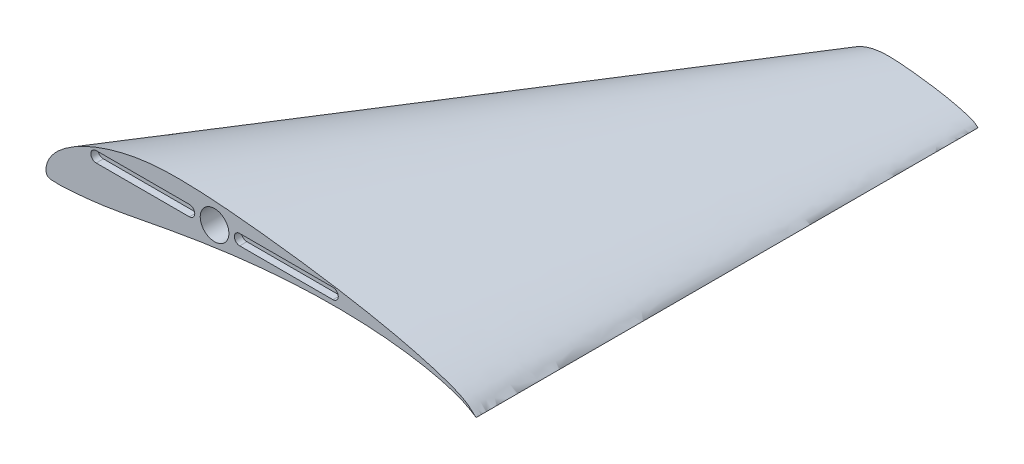
ISO-10303-21;
HEADER;
FILE_DESCRIPTION(('STEP AP214'),'2;1');
FILE_NAME('part.step','',(''),(''),'','','');
FILE_SCHEMA(('AUTOMOTIVE_DESIGN { 1 0 10303 214 1 1 1 1 }'));
ENDSEC;
DATA;
#1=APPLICATION_CONTEXT('core data for automotive mechanical design processes');
#2=APPLICATION_PROTOCOL_DEFINITION('international standard','automotive_design',2000,#1);
#3=PRODUCT_CONTEXT('',#1,'mechanical');
#4=PRODUCT('Part','Part','',(#3));
#5=PRODUCT_RELATED_PRODUCT_CATEGORY('part','',(#4));
#6=PRODUCT_DEFINITION_FORMATION('','',#4);
#7=PRODUCT_DEFINITION_CONTEXT('part definition',#1,'design');
#8=PRODUCT_DEFINITION('design','',#6,#7);
#9=PRODUCT_DEFINITION_SHAPE('','',#8);
#10=(LENGTH_UNIT() NAMED_UNIT(*) SI_UNIT(.MILLI.,.METRE.));
#11=(NAMED_UNIT(*) PLANE_ANGLE_UNIT() SI_UNIT($,.RADIAN.));
#12=(NAMED_UNIT(*) SI_UNIT($,.STERADIAN.) SOLID_ANGLE_UNIT());
#13=UNCERTAINTY_MEASURE_WITH_UNIT(LENGTH_MEASURE(1.E-05),#10,'distance_accuracy_value','');
#14=(GEOMETRIC_REPRESENTATION_CONTEXT(3) GLOBAL_UNCERTAINTY_ASSIGNED_CONTEXT((#13)) GLOBAL_UNIT_ASSIGNED_CONTEXT((#10,
#11,#12)) REPRESENTATION_CONTEXT('',''));
#15=CARTESIAN_POINT('',(0.,0.,0.));
#16=DIRECTION('',(0.,0.,1.));
#17=DIRECTION('',(1.,0.,0.));
#18=AXIS2_PLACEMENT_3D('',#15,#16,#17);
#19=CARTESIAN_POINT('',(0.358648893938825,1.31203835702179,0.));
#20=DIRECTION('',(0.,0.,1.));
#21=DIRECTION('',(-1.,0.,0.));
#22=AXIS2_PLACEMENT_3D('',#19,#20,#21);
#23=PLANE('',#22);
#24=CARTESIAN_POINT('',(40.02,5.,0.));
#25=DIRECTION('',(0.,0.,-1.));
#26=DIRECTION('',(-1.,0.,0.));
#27=AXIS2_PLACEMENT_3D('',#24,#25,#26);
#28=CIRCLE('',#27,0.750000000000008);
#29=CARTESIAN_POINT('',(40.02,5.75000000000001,0.));
#30=VERTEX_POINT('',#29);
#31=CARTESIAN_POINT('',(40.02,4.24999999999999,0.));
#32=VERTEX_POINT('',#31);
#33=EDGE_CURVE('E145',#30,#32,#28,.T.);
#34=ORIENTED_EDGE('',*,*,#33,.T.);
#35=DIRECTION('',(-1.,0.,0.));
#36=VECTOR('',#35,1.);
#37=CARTESIAN_POINT('',(40.02,4.24999999999999,0.));
#38=LINE('',#37,#36);
#39=CARTESIAN_POINT('',(27.02,4.25,0.));
#40=VERTEX_POINT('',#39);
#41=EDGE_CURVE('E163',#32,#40,#38,.T.);
#42=ORIENTED_EDGE('',*,*,#41,.T.);
#43=CARTESIAN_POINT('',(27.02,5.,0.));
#44=DIRECTION('',(0.,0.,-1.));
#45=DIRECTION('',(-1.,0.,0.));
#46=AXIS2_PLACEMENT_3D('',#43,#44,#45);
#47=CIRCLE('',#46,0.749999999999999);
#48=CARTESIAN_POINT('',(27.02,5.75,0.));
#49=VERTEX_POINT('',#48);
#50=EDGE_CURVE('E166',#40,#49,#47,.T.);
#51=ORIENTED_EDGE('',*,*,#50,.T.);
#52=DIRECTION('',(-1.,0.,0.));
#53=VECTOR('',#52,1.);
#54=CARTESIAN_POINT('',(40.02,5.75000000000001,0.));
#55=LINE('',#54,#53);
#56=EDGE_CURVE('E154',#30,#49,#55,.T.);
#57=ORIENTED_EDGE('',*,*,#56,.F.);
#58=EDGE_LOOP('',(#34,#42,#51,#57));
#59=FACE_BOUND('',#58,.T.);
#60=CARTESIAN_POINT('',(23.51,5.,0.));
#61=DIRECTION('',(0.,0.,-1.));
#62=DIRECTION('',(-1.,0.,0.));
#63=AXIS2_PLACEMENT_3D('',#60,#61,#62);
#64=CIRCLE('',#63,2.);
#65=CARTESIAN_POINT('',(21.51,5.,0.));
#66=VERTEX_POINT('',#65);
#67=EDGE_CURVE('E173',#66,#66,#64,.T.);
#68=ORIENTED_EDGE('',*,*,#67,.T.);
#69=EDGE_LOOP('',(#68));
#70=FACE_BOUND('',#69,.T.);
#71=CARTESIAN_POINT('',(60.,0.,0.));
#72=CARTESIAN_POINT('',(60.0003591967076,0.00152743166866113,0.));
#73=CARTESIAN_POINT('',(59.8031171503171,0.148486190866981,0.));
#74=CARTESIAN_POINT('',(59.6363051275394,0.312157693204799,0.));
#75=CARTESIAN_POINT('',(59.265915035483,0.654017791026096,0.));
#76=CARTESIAN_POINT('',(58.828941407944,1.01769187040323,0.));
#77=CARTESIAN_POINT('',(58.2311986071286,1.38431433802317,0.));
#78=CARTESIAN_POINT('',(57.4879028587413,1.73962008144949,0.));
#79=CARTESIAN_POINT('',(56.5905605509476,2.11038996867272,0.));
#80=CARTESIAN_POINT('',(55.5405906841004,2.49165505155028,0.));
#81=CARTESIAN_POINT('',(54.3426606505066,2.87984653664435,0.));
#82=CARTESIAN_POINT('',(53.0044503542957,3.27530791932623,0.));
#83=CARTESIAN_POINT('',(51.5282398733248,3.65993308110928,0.));
#84=CARTESIAN_POINT('',(49.9318628263046,4.06561454332629,0.));
#85=CARTESIAN_POINT('',(48.2145350695117,4.45252726033602,0.));
#86=CARTESIAN_POINT('',(46.3922162813386,4.8372114388325,0.));
#87=CARTESIAN_POINT('',(44.4741846373565,5.21215240354569,0.));
#88=CARTESIAN_POINT('',(42.4720640696188,5.57436949248205,0.));
#89=CARTESIAN_POINT('',(40.3983436281798,5.92287598001367,0.));
#90=CARTESIAN_POINT('',(38.2650079778576,6.25331693697473,0.));
#91=CARTESIAN_POINT('',(36.0858440170008,6.56630027476171,0.));
#92=CARTESIAN_POINT('',(33.8748202071201,6.85935611065016,0.));
#93=CARTESIAN_POINT('',(31.6479502828675,7.13154383170439,0.));
#94=CARTESIAN_POINT('',(29.4230365764783,7.38479145195094,0.));
#95=CARTESIAN_POINT('',(27.2184980068069,7.61270867154978,0.));
#96=CARTESIAN_POINT('',(25.052294626095,7.81102981614016,0.));
#97=CARTESIAN_POINT('',(22.9396617347882,7.96859227406435,0.));
#98=CARTESIAN_POINT('',(20.8926674686435,8.07697502334032,0.));
#99=CARTESIAN_POINT('',(18.9226999256131,8.12377974427893,0.));
#100=CARTESIAN_POINT('',(17.0398509693804,8.11879768752978,0.));
#101=CARTESIAN_POINT('',(15.2476328415943,8.02660789751006,0.));
#102=CARTESIAN_POINT('',(13.5453512859509,7.839789441016,0.));
#103=CARTESIAN_POINT('',(11.926076695069,7.57562537309296,0.));
#104=CARTESIAN_POINT('',(10.3894182556015,7.23340315512576,0.));
#105=CARTESIAN_POINT('',(8.93695465998708,6.83209986705336,0.));
#106=CARTESIAN_POINT('',(7.57483146116029,6.37882320453374,0.));
#107=CARTESIAN_POINT('',(6.30884164347269,5.88417305863267,0.));
#108=CARTESIAN_POINT('',(5.14685221592727,5.35079958311253,0.));
#109=CARTESIAN_POINT('',(4.09258962341009,4.78953179393415,0.));
#110=CARTESIAN_POINT('',(3.15178940082182,4.20675239007223,0.));
#111=CARTESIAN_POINT('',(2.33035140361199,3.61035853790743,0.));
#112=CARTESIAN_POINT('',(1.62861455630535,3.01299152689761,0.));
#113=CARTESIAN_POINT('',(1.05675527613261,2.40813064719845,0.));
#114=CARTESIAN_POINT('',(0.617494407148315,1.80101400701995,0.));
#115=CARTESIAN_POINT('',(0.2930234664486,1.21037036917539,0.));
#116=CARTESIAN_POINT('',(0.0850719316488285,0.649582218808172,0.));
#117=CARTESIAN_POINT('',(-0.0140169847637187,0.131974925650224,0.));
#118=CARTESIAN_POINT('',(0.0051098577528765,-0.305798157678561,0.));
#119=CARTESIAN_POINT('',(0.117816244960925,-0.707306615975616,0.));
#120=CARTESIAN_POINT('',(0.536763933386814,-0.90661835605631,0.));
#121=CARTESIAN_POINT('',(1.10004460153965,-0.934581165480218,0.));
#122=CARTESIAN_POINT('',(1.8706104555078,-0.961682830343907,0.));
#123=CARTESIAN_POINT('',(2.8396514000118,-0.919895750020732,0.));
#124=CARTESIAN_POINT('',(3.99621535818404,-0.843103830870702,0.));
#125=CARTESIAN_POINT('',(5.3274309804443,-0.720099828376295,0.));
#126=CARTESIAN_POINT('',(6.81967624191513,-0.553670124333049,0.));
#127=CARTESIAN_POINT('',(8.46567456259763,-0.340243437522128,0.));
#128=CARTESIAN_POINT('',(10.2646215673956,-0.0419478858174395,0.));
#129=CARTESIAN_POINT('',(12.2252761749415,0.332109900745339,0.));
#130=CARTESIAN_POINT('',(14.3574403385057,0.739204137605637,0.));
#131=CARTESIAN_POINT('',(16.650692213626,1.16903728804964,0.));
#132=CARTESIAN_POINT('',(19.0906277666481,1.60376835003282,0.));
#133=CARTESIAN_POINT('',(21.6593280235428,2.02708237663987,0.));
#134=CARTESIAN_POINT('',(24.3368648292331,2.42484380478589,0.));
#135=CARTESIAN_POINT('',(27.1001632949703,2.78246131453942,0.));
#136=CARTESIAN_POINT('',(29.9243738514525,3.08952194695553,0.));
#137=CARTESIAN_POINT('',(32.7828181702501,3.33224073356768,0.));
#138=CARTESIAN_POINT('',(35.6468110581785,3.5042984247576,0.));
#139=CARTESIAN_POINT('',(38.4864311413307,3.59888806789702,0.));
#140=CARTESIAN_POINT('',(41.270873524825,3.61083541756505,0.));
#141=CARTESIAN_POINT('',(43.9690733929395,3.53932870712883,0.));
#142=CARTESIAN_POINT('',(46.5501347587453,3.38604192261378,0.));
#143=CARTESIAN_POINT('',(48.9830207247781,3.15295287632235,0.));
#144=CARTESIAN_POINT('',(51.2387663269364,2.84900866508274,0.));
#145=CARTESIAN_POINT('',(53.2880024798237,2.48302860424677,0.));
#146=CARTESIAN_POINT('',(55.1067027969541,2.06726981959666,0.));
#147=CARTESIAN_POINT('',(56.6613494668884,1.62238939798338,0.));
#148=CARTESIAN_POINT('',(57.9336674364374,1.14757460538814,0.));
#149=CARTESIAN_POINT('',(58.8414335563824,0.71305828177372,0.));
#150=CARTESIAN_POINT('',(59.510705283188,0.311289893981384,0.));
#151=CARTESIAN_POINT('',(59.7678107009083,0.155812155482037,0.));
#152=CARTESIAN_POINT('',(59.9996335008558,-0.00155848421639207,0.));
#153=CARTESIAN_POINT('',(60.,0.,0.));
#154=B_SPLINE_CURVE_WITH_KNOTS('',3,(#71,#72,#73,#74,#75,#76,#77,#78,#79,#80,#81,#82,#83,#84,
#85,#86,#87,#88,#89,#90,#91,#92,#93,#94,#95,#96,#97,#98,#99,#100,#101,#102,#103,#104,#105,#106,
#107,#108,#109,#110,#111,#112,#113,#114,#115,#116,#117,#118,#119,#120,#121,#122,#123,#124,#125,
#126,#127,#128,#129,#130,#131,#132,#133,#134,#135,#136,#137,#138,#139,#140,#141,#142,#143,#144,
#145,#146,#147,#148,#149,#150,#151,#152,#153),.UNSPECIFIED.,.T.,.F.,(4,1,1,1,1,1,1,1,1,1,1,1,1,
1,1,1,1,1,1,1,1,1,1,1,1,1,1,1,1,1,1,1,1,1,1,1,1,1,1,1,1,1,1,1,1,1,1,1,1,1,1,1,1,1,1,1,1,1,1,1,1,
1,1,1,1,1,1,1,1,1,1,1,1,1,1,1,1,1,1,1,4),(0.,0.000979678264274593,0.00364886480154598,
0.0074835039211375,0.0120952859160778,0.0175256034270145,0.0240517973546713,0.0317830734940624,
0.0406778574448995,0.0507103373936484,0.0618332736939838,0.0739782064365048,0.0871175142640213,
0.101144399967861,0.115989999025582,0.131569794799979,0.147787764168625,0.164550313847436,
0.18175730453571,0.199311377000208,0.217094506604148,0.234989676272761,0.252856343827104,
0.270540067198934,0.287886265256047,0.304772935778624,0.321100929178702,0.336805584475211,
0.351799564707225,0.36603060578736,0.379615227120614,0.392652524490402,0.405169929353884,
0.417171498359163,0.428603104471847,0.439418554475609,0.449596188777818,0.459101688677971,
0.467907493465564,0.475987922499971,0.48330859579372,0.48987413960304,0.495802885785267,
0.501149051620522,0.505902716612247,0.510046414883828,0.513578959578029,0.51644657759361,
0.519349705653263,0.52382301147072,0.529973454728372,0.537715320706753,0.54696751748529,
0.557637047524215,0.569620170444662,0.582803823079722,0.597246670080713,0.613134757411944,
0.630443333580543,0.649055870293966,0.668822017748496,0.68959473994942,0.711189442398585,
0.733426496549274,0.756093941450603,0.778988394156727,0.80188953968707,0.824566471200233,
0.846792174293647,0.868338195473131,0.888978082822463,0.908491945289234,0.926658714643544,
0.943286152105764,0.958169180164938,0.971135800800317,0.981955610055375,0.990251783989627,
0.995852562256305,0.999000404965184,1.),.UNSPECIFIED.);
#155=CARTESIAN_POINT('',(60.,0.,0.));
#156=VERTEX_POINT('',#155);
#157=EDGE_CURVE('E12',#156,#156,#154,.T.);
#158=ORIENTED_EDGE('',*,*,#157,.T.);
#159=EDGE_LOOP('',(#158));
#160=FACE_BOUND('',#159,.T.);
#161=DIRECTION('',(1.,0.,0.));
#162=VECTOR('',#161,1.);
#163=CARTESIAN_POINT('',(7.,5.75000000000001,0.));
#164=LINE('',#163,#162);
#165=CARTESIAN_POINT('',(7.,5.75000000000001,0.));
#166=VERTEX_POINT('',#165);
#167=CARTESIAN_POINT('',(20.,5.75,0.));
#168=VERTEX_POINT('',#167);
#169=EDGE_CURVE('E120',#166,#168,#164,.T.);
#170=ORIENTED_EDGE('',*,*,#169,.T.);
#171=CARTESIAN_POINT('',(20.,5.,0.));
#172=DIRECTION('',(0.,0.,1.));
#173=DIRECTION('',(1.,0.,0.));
#174=AXIS2_PLACEMENT_3D('',#171,#172,#173);
#175=CIRCLE('',#174,0.749999999999999);
#176=CARTESIAN_POINT('',(20.,4.25,0.));
#177=VERTEX_POINT('',#176);
#178=EDGE_CURVE('E127',#177,#168,#175,.T.);
#179=ORIENTED_EDGE('',*,*,#178,.F.);
#180=DIRECTION('',(1.,0.,0.));
#181=VECTOR('',#180,1.);
#182=CARTESIAN_POINT('',(7.,4.24999999999999,0.));
#183=LINE('',#182,#181);
#184=CARTESIAN_POINT('',(7.,4.24999999999999,0.));
#185=VERTEX_POINT('',#184);
#186=EDGE_CURVE('E133',#185,#177,#183,.T.);
#187=ORIENTED_EDGE('',*,*,#186,.F.);
#188=CARTESIAN_POINT('',(7.,5.,0.));
#189=DIRECTION('',(0.,0.,1.));
#190=DIRECTION('',(1.,0.,0.));
#191=AXIS2_PLACEMENT_3D('',#188,#189,#190);
#192=CIRCLE('',#191,0.750000000000008);
#193=EDGE_CURVE('E135',#166,#185,#192,.T.);
#194=ORIENTED_EDGE('',*,*,#193,.F.);
#195=EDGE_LOOP('',(#170,#179,#187,#194));
#196=FACE_BOUND('',#195,.T.);
#197=ADVANCED_FACE('F44',(#59,#70,#160,#196),#23,.T.);
#198=CARTESIAN_POINT('',(42.1075946681816,0.393611507106538,-70.));
#199=DIRECTION('',(0.,0.,1.));
#200=DIRECTION('',(-1.,0.,0.));
#201=AXIS2_PLACEMENT_3D('',#198,#199,#200);
#202=PLANE('',#201);
#203=CARTESIAN_POINT('',(60.,0.,-70.));
#204=CARTESIAN_POINT('',(60.0001077590123,0.00045822950059834,-70.));
#205=CARTESIAN_POINT('',(59.9409351450951,0.0445458572600942,-70.));
#206=CARTESIAN_POINT('',(59.8908915382618,0.0936473079614398,-70.));
#207=CARTESIAN_POINT('',(59.7797745106449,0.196205337307829,-70.));
#208=CARTESIAN_POINT('',(59.6486824223832,0.305307561120969,-70.));
#209=CARTESIAN_POINT('',(59.4693595821386,0.415294301406952,-70.));
#210=CARTESIAN_POINT('',(59.2463708576224,0.521886024434847,-70.));
#211=CARTESIAN_POINT('',(58.9771681652843,0.633116990601815,-70.));
#212=CARTESIAN_POINT('',(58.6621772052301,0.747496515465083,-70.));
#213=CARTESIAN_POINT('',(58.302798195152,0.863953960993304,-70.));
#214=CARTESIAN_POINT('',(57.9013351062887,0.982592375797868,-70.));
#215=CARTESIAN_POINT('',(57.4584719619975,1.09797992433278,-70.));
#216=CARTESIAN_POINT('',(56.9795588478914,1.21968436299789,-70.));
#217=CARTESIAN_POINT('',(56.4643605208535,1.33575817810081,-70.));
#218=CARTESIAN_POINT('',(55.9176648844016,1.45116343164975,-70.));
#219=CARTESIAN_POINT('',(55.3422553912069,1.56364572106371,-70.));
#220=CARTESIAN_POINT('',(54.7416192208856,1.67231084774462,-70.));
#221=CARTESIAN_POINT('',(54.119503088454,1.7768627940041,-70.));
#222=CARTESIAN_POINT('',(53.4795023933573,1.87599508109242,-70.));
#223=CARTESIAN_POINT('',(52.8257532051002,1.96989008242851,-70.));
#224=CARTESIAN_POINT('',(52.162446062136,2.05780683319505,-70.));
#225=CARTESIAN_POINT('',(51.4943850848603,2.13946314951132,-70.));
#226=CARTESIAN_POINT('',(50.8269109729435,2.21543743558528,-70.));
#227=CARTESIAN_POINT('',(50.1655494020421,2.28381260146493,-70.));
#228=CARTESIAN_POINT('',(49.5156883878285,2.34330894484205,-70.));
#229=CARTESIAN_POINT('',(48.8818985204364,2.39057768221931,-70.));
#230=CARTESIAN_POINT('',(48.2678002405931,2.42309250700209,-70.));
#231=CARTESIAN_POINT('',(47.6768099776839,2.43713392328368,-70.));
#232=CARTESIAN_POINT('',(47.1119552908141,2.43563930625894,-70.));
#233=CARTESIAN_POINT('',(46.5742898524783,2.40798236925302,-70.));
#234=CARTESIAN_POINT('',(46.0636053857853,2.3519368323048,-70.));
#235=CARTESIAN_POINT('',(45.5778230085207,2.27268761192789,-70.));
#236=CARTESIAN_POINT('',(45.1168254766805,2.17002094653773,-70.));
#237=CARTESIAN_POINT('',(44.6810863979961,2.04962996011601,-70.));
#238=CARTESIAN_POINT('',(44.2724494383481,1.91364696136012,-70.));
#239=CARTESIAN_POINT('',(43.8926524930418,1.7652519175898,-70.));
#240=CARTESIAN_POINT('',(43.5440556647782,1.60523987493376,-70.));
#241=CARTESIAN_POINT('',(43.227776887023,1.43685953818025,-70.));
#242=CARTESIAN_POINT('',(42.9455368202465,1.26202571702167,-70.));
#243=CARTESIAN_POINT('',(42.6991054210836,1.08310756137223,-70.));
#244=CARTESIAN_POINT('',(42.4885843668916,0.903897458069282,-70.));
#245=CARTESIAN_POINT('',(42.3170265828398,0.722439194159534,-70.));
#246=CARTESIAN_POINT('',(42.1852483221445,0.540304202105985,-70.));
#247=CARTESIAN_POINT('',(42.0879070399346,0.363111110752618,-70.));
#248=CARTESIAN_POINT('',(42.0255215794946,0.194874665642452,-70.));
#249=CARTESIAN_POINT('',(41.9957949045709,0.0395924776950672,-70.));
#250=CARTESIAN_POINT('',(42.0015329573259,-0.0917394473035684,-70.));
#251=CARTESIAN_POINT('',(42.0353448734883,-0.212191984792685,-70.));
#252=CARTESIAN_POINT('',(42.161029180016,-0.271985506816893,-70.));
#253=CARTESIAN_POINT('',(42.3300133804619,-0.280374349644065,-70.));
#254=CARTESIAN_POINT('',(42.5611831366523,-0.288504849103172,-70.));
#255=CARTESIAN_POINT('',(42.8518954200035,-0.27596872500622,-70.));
#256=CARTESIAN_POINT('',(43.1988646074552,-0.252931149261211,-70.));
#257=CARTESIAN_POINT('',(43.5982292941333,-0.216029948512889,-70.));
#258=CARTESIAN_POINT('',(44.0459028725745,-0.166101037299915,-70.));
#259=CARTESIAN_POINT('',(44.5397023687793,-0.102073031256638,-70.));
#260=CARTESIAN_POINT('',(45.0793864702187,-0.0125843657452318,-70.));
#261=CARTESIAN_POINT('',(45.6675828524825,0.0996329702236017,-70.));
#262=CARTESIAN_POINT('',(46.3072321015517,0.221761241281691,-70.));
#263=CARTESIAN_POINT('',(46.9952076640878,0.350711186414893,-70.));
#264=CARTESIAN_POINT('',(47.7271883299944,0.481130505009847,-70.));
#265=CARTESIAN_POINT('',(48.4977984070628,0.608124712991961,-70.));
#266=CARTESIAN_POINT('',(49.3010594487699,0.727453141435768,-70.));
#267=CARTESIAN_POINT('',(50.1300489884911,0.834738394361826,-70.));
#268=CARTESIAN_POINT('',(50.9773121554357,0.926856584086659,-70.));
#269=CARTESIAN_POINT('',(51.834845451075,0.999672220070305,-70.));
#270=CARTESIAN_POINT('',(52.6940433174535,1.05128952742728,-70.));
#271=CARTESIAN_POINT('',(53.5459293423992,1.07966642036911,-70.));
#272=CARTESIAN_POINT('',(54.3812620574475,1.08325062526952,-70.));
#273=CARTESIAN_POINT('',(55.1907220178818,1.06179861213865,-70.));
#274=CARTESIAN_POINT('',(55.9650404276236,1.01581257678414,-70.));
#275=CARTESIAN_POINT('',(56.6949062174334,0.945885862896706,-70.));
#276=CARTESIAN_POINT('',(57.3716298980809,0.854702599524822,-70.));
#277=CARTESIAN_POINT('',(57.9864007439471,0.744908581274031,-70.));
#278=CARTESIAN_POINT('',(58.5320108390862,0.620180945878999,-70.));
#279=CARTESIAN_POINT('',(58.9984048400665,0.486716819395014,-70.));
#280=CARTESIAN_POINT('',(59.3801002309312,0.344272381616441,-70.));
#281=CARTESIAN_POINT('',(59.6524300669147,0.213917484532116,-70.));
#282=CARTESIAN_POINT('',(59.8532115849564,0.0933869681944152,-70.));
#283=CARTESIAN_POINT('',(59.9303432102725,0.0467436466446112,-70.));
#284=CARTESIAN_POINT('',(59.9998900502568,-0.000467545264917618,-70.));
#285=CARTESIAN_POINT('',(60.,0.,-70.));
#286=B_SPLINE_CURVE_WITH_KNOTS('',3,(#203,#204,#205,#206,#207,#208,#209,#210,#211,#212,#213,
#214,#215,#216,#217,#218,#219,#220,#221,#222,#223,#224,#225,#226,#227,#228,#229,#230,#231,#232,
#233,#234,#235,#236,#237,#238,#239,#240,#241,#242,#243,#244,#245,#246,#247,#248,#249,#250,#251,
#252,#253,#254,#255,#256,#257,#258,#259,#260,#261,#262,#263,#264,#265,#266,#267,#268,#269,#270,
#271,#272,#273,#274,#275,#276,#277,#278,#279,#280,#281,#282,#283,#284,#285),.UNSPECIFIED.,.T.,
.F.,(4,1,1,1,1,1,1,1,1,1,1,1,1,1,1,1,1,1,1,1,1,1,1,1,1,1,1,1,1,1,1,1,1,1,1,1,1,1,1,1,1,1,1,1,1,
1,1,1,1,1,1,1,1,1,1,1,1,1,1,1,1,1,1,1,1,1,1,1,1,1,1,1,1,1,1,1,1,1,1,1,4),(0.,
0.000979678264274593,0.00364886480154598,0.0074835039211375,0.0120952859160778,
0.0175256034270145,0.0240517973546713,0.0317830734940624,0.0406778574448995,0.0507103373936484,
0.0618332736939838,0.0739782064365048,0.0871175142640213,0.101144399967861,0.115989999025582,
0.131569794799979,0.147787764168625,0.164550313847436,0.18175730453571,0.199311377000208,
0.217094506604148,0.234989676272761,0.252856343827104,0.270540067198934,0.287886265256047,
0.304772935778624,0.321100929178702,0.336805584475211,0.351799564707225,0.36603060578736,
0.379615227120614,0.392652524490402,0.405169929353884,0.417171498359163,0.428603104471847,
0.439418554475609,0.449596188777818,0.459101688677971,0.467907493465564,0.475987922499971,
0.48330859579372,0.48987413960304,0.495802885785267,0.501149051620522,0.505902716612247,
0.510046414883828,0.513578959578029,0.51644657759361,0.519349705653263,0.52382301147072,
0.529973454728372,0.537715320706753,0.54696751748529,0.557637047524215,0.569620170444662,
0.582803823079722,0.597246670080713,0.613134757411944,0.630443333580543,0.649055870293966,
0.668822017748496,0.68959473994942,0.711189442398585,0.733426496549274,0.756093941450603,
0.778988394156727,0.80188953968707,0.824566471200233,0.846792174293647,0.868338195473131,
0.888978082822463,0.908491945289234,0.926658714643544,0.943286152105764,0.958169180164938,
0.971135800800317,0.981955610055375,0.990251783989627,0.995852562256305,0.999000404965184,1.),.UNSPECIFIED.);
#287=CARTESIAN_POINT('',(60.,0.,-70.));
#288=VERTEX_POINT('',#287);
#289=EDGE_CURVE('E54',#288,#288,#286,.T.);
#290=ORIENTED_EDGE('',*,*,#289,.F.);
#291=EDGE_LOOP('',(#290));
#292=FACE_BOUND('',#291,.T.);
#293=ADVANCED_FACE('F205',(#292),#202,.F.);
#294=CARTESIAN_POINT('',(60.,0.,-70.));
#295=CARTESIAN_POINT('',(60.,0.,0.));
#296=CARTESIAN_POINT('',(59.9998900502568,-0.000467545264917618,-70.));
#297=CARTESIAN_POINT('',(59.9996335008558,-0.00155848421639207,0.));
#298=CARTESIAN_POINT('',(59.9303432102725,0.0467436466446112,-70.));
#299=CARTESIAN_POINT('',(59.7678107009083,0.155812155482037,0.));
#300=CARTESIAN_POINT('',(59.8532115849564,0.0933869681944152,-70.));
#301=CARTESIAN_POINT('',(59.510705283188,0.311289893981384,0.));
#302=CARTESIAN_POINT('',(59.6524300669147,0.213917484532116,-70.));
#303=CARTESIAN_POINT('',(58.8414335563824,0.71305828177372,0.));
#304=CARTESIAN_POINT('',(59.3801002309312,0.344272381616441,-70.));
#305=CARTESIAN_POINT('',(57.9336674364374,1.14757460538814,0.));
#306=CARTESIAN_POINT('',(58.9984048400665,0.486716819395014,-70.));
#307=CARTESIAN_POINT('',(56.6613494668884,1.62238939798338,0.));
#308=CARTESIAN_POINT('',(58.5320108390862,0.620180945878999,-70.));
#309=CARTESIAN_POINT('',(55.1067027969541,2.06726981959666,0.));
#310=CARTESIAN_POINT('',(57.9864007439471,0.744908581274031,-70.));
#311=CARTESIAN_POINT('',(53.2880024798237,2.48302860424677,0.));
#312=CARTESIAN_POINT('',(57.3716298980809,0.854702599524822,-70.));
#313=CARTESIAN_POINT('',(51.2387663269364,2.84900866508274,0.));
#314=CARTESIAN_POINT('',(56.6949062174334,0.945885862896706,-70.));
#315=CARTESIAN_POINT('',(48.9830207247781,3.15295287632235,0.));
#316=CARTESIAN_POINT('',(55.9650404276236,1.01581257678414,-70.));
#317=CARTESIAN_POINT('',(46.5501347587453,3.38604192261378,0.));
#318=CARTESIAN_POINT('',(55.1907220178818,1.06179861213865,-70.));
#319=CARTESIAN_POINT('',(43.9690733929395,3.53932870712883,0.));
#320=CARTESIAN_POINT('',(54.3812620574475,1.08325062526952,-70.));
#321=CARTESIAN_POINT('',(41.270873524825,3.61083541756505,0.));
#322=CARTESIAN_POINT('',(53.5459293423992,1.07966642036911,-70.));
#323=CARTESIAN_POINT('',(38.4864311413307,3.59888806789702,0.));
#324=CARTESIAN_POINT('',(52.6940433174535,1.05128952742728,-70.));
#325=CARTESIAN_POINT('',(35.6468110581785,3.5042984247576,0.));
#326=CARTESIAN_POINT('',(51.834845451075,0.999672220070305,-70.));
#327=CARTESIAN_POINT('',(32.7828181702501,3.33224073356768,0.));
#328=CARTESIAN_POINT('',(50.9773121554357,0.926856584086659,-70.));
#329=CARTESIAN_POINT('',(29.9243738514525,3.08952194695553,0.));
#330=CARTESIAN_POINT('',(50.1300489884911,0.834738394361826,-70.));
#331=CARTESIAN_POINT('',(27.1001632949703,2.78246131453942,0.));
#332=CARTESIAN_POINT('',(49.3010594487699,0.727453141435768,-70.));
#333=CARTESIAN_POINT('',(24.3368648292331,2.42484380478589,0.));
#334=CARTESIAN_POINT('',(48.4977984070628,0.608124712991961,-70.));
#335=CARTESIAN_POINT('',(21.6593280235428,2.02708237663987,0.));
#336=CARTESIAN_POINT('',(47.7271883299944,0.481130505009847,-70.));
#337=CARTESIAN_POINT('',(19.0906277666481,1.60376835003282,0.));
#338=CARTESIAN_POINT('',(46.9952076640878,0.350711186414893,-70.));
#339=CARTESIAN_POINT('',(16.650692213626,1.16903728804964,0.));
#340=CARTESIAN_POINT('',(46.3072321015517,0.221761241281691,-70.));
#341=CARTESIAN_POINT('',(14.3574403385057,0.739204137605637,0.));
#342=CARTESIAN_POINT('',(45.6675828524825,0.0996329702236017,-70.));
#343=CARTESIAN_POINT('',(12.2252761749415,0.332109900745339,0.));
#344=CARTESIAN_POINT('',(45.0793864702187,-0.0125843657452318,-70.));
#345=CARTESIAN_POINT('',(10.2646215673956,-0.0419478858174395,0.));
#346=CARTESIAN_POINT('',(44.5397023687793,-0.102073031256638,-70.));
#347=CARTESIAN_POINT('',(8.46567456259763,-0.340243437522128,0.));
#348=CARTESIAN_POINT('',(44.0459028725745,-0.166101037299915,-70.));
#349=CARTESIAN_POINT('',(6.81967624191513,-0.553670124333049,0.));
#350=CARTESIAN_POINT('',(43.5982292941333,-0.216029948512889,-70.));
#351=CARTESIAN_POINT('',(5.3274309804443,-0.720099828376295,0.));
#352=CARTESIAN_POINT('',(43.1988646074552,-0.252931149261211,-70.));
#353=CARTESIAN_POINT('',(3.99621535818404,-0.843103830870702,0.));
#354=CARTESIAN_POINT('',(42.8518954200035,-0.27596872500622,-70.));
#355=CARTESIAN_POINT('',(2.8396514000118,-0.919895750020732,0.));
#356=CARTESIAN_POINT('',(42.5611831366523,-0.288504849103172,-70.));
#357=CARTESIAN_POINT('',(1.8706104555078,-0.961682830343907,0.));
#358=CARTESIAN_POINT('',(42.3300133804619,-0.280374349644065,-70.));
#359=CARTESIAN_POINT('',(1.10004460153965,-0.934581165480218,0.));
#360=CARTESIAN_POINT('',(42.161029180016,-0.271985506816893,-70.));
#361=CARTESIAN_POINT('',(0.536763933386814,-0.90661835605631,0.));
#362=CARTESIAN_POINT('',(42.0353448734883,-0.212191984792685,-70.));
#363=CARTESIAN_POINT('',(0.117816244960925,-0.707306615975616,0.));
#364=CARTESIAN_POINT('',(42.0015329573259,-0.0917394473035684,-70.));
#365=CARTESIAN_POINT('',(0.0051098577528765,-0.305798157678561,0.));
#366=CARTESIAN_POINT('',(41.9957949045709,0.0395924776950672,-70.));
#367=CARTESIAN_POINT('',(-0.0140169847637187,0.131974925650224,0.));
#368=CARTESIAN_POINT('',(42.0255215794946,0.194874665642452,-70.));
#369=CARTESIAN_POINT('',(0.0850719316488285,0.649582218808172,0.));
#370=CARTESIAN_POINT('',(42.0879070399346,0.363111110752618,-70.));
#371=CARTESIAN_POINT('',(0.2930234664486,1.21037036917539,0.));
#372=CARTESIAN_POINT('',(42.1852483221445,0.540304202105985,-70.));
#373=CARTESIAN_POINT('',(0.617494407148315,1.80101400701995,0.));
#374=CARTESIAN_POINT('',(42.3170265828398,0.722439194159534,-70.));
#375=CARTESIAN_POINT('',(1.05675527613261,2.40813064719845,0.));
#376=CARTESIAN_POINT('',(42.4885843668916,0.903897458069282,-70.));
#377=CARTESIAN_POINT('',(1.62861455630535,3.01299152689761,0.));
#378=CARTESIAN_POINT('',(42.6991054210836,1.08310756137223,-70.));
#379=CARTESIAN_POINT('',(2.33035140361199,3.61035853790743,0.));
#380=CARTESIAN_POINT('',(42.9455368202465,1.26202571702167,-70.));
#381=CARTESIAN_POINT('',(3.15178940082182,4.20675239007223,0.));
#382=CARTESIAN_POINT('',(43.227776887023,1.43685953818025,-70.));
#383=CARTESIAN_POINT('',(4.09258962341009,4.78953179393415,0.));
#384=CARTESIAN_POINT('',(43.5440556647782,1.60523987493376,-70.));
#385=CARTESIAN_POINT('',(5.14685221592727,5.35079958311253,0.));
#386=CARTESIAN_POINT('',(43.8926524930418,1.7652519175898,-70.));
#387=CARTESIAN_POINT('',(6.30884164347269,5.88417305863267,0.));
#388=CARTESIAN_POINT('',(44.2724494383481,1.91364696136012,-70.));
#389=CARTESIAN_POINT('',(7.57483146116029,6.37882320453374,0.));
#390=CARTESIAN_POINT('',(44.6810863979961,2.04962996011601,-70.));
#391=CARTESIAN_POINT('',(8.93695465998708,6.83209986705336,0.));
#392=CARTESIAN_POINT('',(45.1168254766805,2.17002094653773,-70.));
#393=CARTESIAN_POINT('',(10.3894182556015,7.23340315512576,0.));
#394=CARTESIAN_POINT('',(45.5778230085207,2.27268761192789,-70.));
#395=CARTESIAN_POINT('',(11.926076695069,7.57562537309296,0.));
#396=CARTESIAN_POINT('',(46.0636053857853,2.3519368323048,-70.));
#397=CARTESIAN_POINT('',(13.5453512859509,7.839789441016,0.));
#398=CARTESIAN_POINT('',(46.5742898524783,2.40798236925302,-70.));
#399=CARTESIAN_POINT('',(15.2476328415943,8.02660789751006,0.));
#400=CARTESIAN_POINT('',(47.1119552908141,2.43563930625894,-70.));
#401=CARTESIAN_POINT('',(17.0398509693804,8.11879768752978,0.));
#402=CARTESIAN_POINT('',(47.6768099776839,2.43713392328368,-70.));
#403=CARTESIAN_POINT('',(18.9226999256131,8.12377974427893,0.));
#404=CARTESIAN_POINT('',(48.2678002405931,2.42309250700209,-70.));
#405=CARTESIAN_POINT('',(20.8926674686435,8.07697502334032,0.));
#406=CARTESIAN_POINT('',(48.8818985204364,2.39057768221931,-70.));
#407=CARTESIAN_POINT('',(22.9396617347882,7.96859227406435,0.));
#408=CARTESIAN_POINT('',(49.5156883878285,2.34330894484205,-70.));
#409=CARTESIAN_POINT('',(25.052294626095,7.81102981614016,0.));
#410=CARTESIAN_POINT('',(50.1655494020421,2.28381260146493,-70.));
#411=CARTESIAN_POINT('',(27.2184980068069,7.61270867154978,0.));
#412=CARTESIAN_POINT('',(50.8269109729435,2.21543743558528,-70.));
#413=CARTESIAN_POINT('',(29.4230365764783,7.38479145195094,0.));
#414=CARTESIAN_POINT('',(51.4943850848603,2.13946314951132,-70.));
#415=CARTESIAN_POINT('',(31.6479502828675,7.13154383170439,0.));
#416=CARTESIAN_POINT('',(52.162446062136,2.05780683319505,-70.));
#417=CARTESIAN_POINT('',(33.8748202071201,6.85935611065016,0.));
#418=CARTESIAN_POINT('',(52.8257532051002,1.96989008242851,-70.));
#419=CARTESIAN_POINT('',(36.0858440170008,6.56630027476171,0.));
#420=CARTESIAN_POINT('',(53.4795023933573,1.87599508109242,-70.));
#421=CARTESIAN_POINT('',(38.2650079778576,6.25331693697473,0.));
#422=CARTESIAN_POINT('',(54.119503088454,1.7768627940041,-70.));
#423=CARTESIAN_POINT('',(40.3983436281798,5.92287598001367,0.));
#424=CARTESIAN_POINT('',(54.7416192208856,1.67231084774462,-70.));
#425=CARTESIAN_POINT('',(42.4720640696188,5.57436949248205,0.));
#426=CARTESIAN_POINT('',(55.3422553912069,1.56364572106371,-70.));
#427=CARTESIAN_POINT('',(44.4741846373565,5.21215240354569,0.));
#428=CARTESIAN_POINT('',(55.9176648844016,1.45116343164975,-70.));
#429=CARTESIAN_POINT('',(46.3922162813386,4.8372114388325,0.));
#430=CARTESIAN_POINT('',(56.4643605208535,1.33575817810081,-70.));
#431=CARTESIAN_POINT('',(48.2145350695117,4.45252726033602,0.));
#432=CARTESIAN_POINT('',(56.9795588478914,1.21968436299789,-70.));
#433=CARTESIAN_POINT('',(49.9318628263046,4.06561454332629,0.));
#434=CARTESIAN_POINT('',(57.4584719619975,1.09797992433278,-70.));
#435=CARTESIAN_POINT('',(51.5282398733248,3.65993308110928,0.));
#436=CARTESIAN_POINT('',(57.9013351062887,0.982592375797868,-70.));
#437=CARTESIAN_POINT('',(53.0044503542957,3.27530791932623,0.));
#438=CARTESIAN_POINT('',(58.302798195152,0.863953960993304,-70.));
#439=CARTESIAN_POINT('',(54.3426606505066,2.87984653664435,0.));
#440=CARTESIAN_POINT('',(58.6621772052301,0.747496515465083,-70.));
#441=CARTESIAN_POINT('',(55.5405906841004,2.49165505155028,0.));
#442=CARTESIAN_POINT('',(58.9771681652843,0.633116990601815,-70.));
#443=CARTESIAN_POINT('',(56.5905605509476,2.11038996867272,0.));
#444=CARTESIAN_POINT('',(59.2463708576224,0.521886024434847,-70.));
#445=CARTESIAN_POINT('',(57.4879028587413,1.73962008144949,0.));
#446=CARTESIAN_POINT('',(59.4693595821386,0.415294301406952,-70.));
#447=CARTESIAN_POINT('',(58.2311986071286,1.38431433802317,0.));
#448=CARTESIAN_POINT('',(59.6486824223832,0.305307561120969,-70.));
#449=CARTESIAN_POINT('',(58.828941407944,1.01769187040323,0.));
#450=CARTESIAN_POINT('',(59.7797745106449,0.196205337307829,-70.));
#451=CARTESIAN_POINT('',(59.265915035483,0.654017791026096,0.));
#452=CARTESIAN_POINT('',(59.8908915382618,0.0936473079614398,-70.));
#453=CARTESIAN_POINT('',(59.6363051275394,0.312157693204799,0.));
#454=CARTESIAN_POINT('',(59.9409351450951,0.0445458572600942,-70.));
#455=CARTESIAN_POINT('',(59.8031171503171,0.148486190866981,0.));
#456=CARTESIAN_POINT('',(60.0001077590123,0.000458229500598223,-70.));
#457=CARTESIAN_POINT('',(60.0003591967076,0.00152743166866073,0.));
#458=CARTESIAN_POINT('',(60.,0.,-70.));
#459=CARTESIAN_POINT('',(60.,0.,0.));
#460=B_SPLINE_SURFACE_WITH_KNOTS('',3,1,((#294,#295),(#296,#297),(#298,#299),(#300,#301),(#302,
#303),(#304,#305),(#306,#307),(#308,#309),(#310,#311),(#312,#313),(#314,#315),(#316,#317),(#318,
#319),(#320,#321),(#322,#323),(#324,#325),(#326,#327),(#328,#329),(#330,#331),(#332,#333),(#334,
#335),(#336,#337),(#338,#339),(#340,#341),(#342,#343),(#344,#345),(#346,#347),(#348,#349),(#350,
#351),(#352,#353),(#354,#355),(#356,#357),(#358,#359),(#360,#361),(#362,#363),(#364,#365),(#366,
#367),(#368,#369),(#370,#371),(#372,#373),(#374,#375),(#376,#377),(#378,#379),(#380,#381),(#382,
#383),(#384,#385),(#386,#387),(#388,#389),(#390,#391),(#392,#393),(#394,#395),(#396,#397),(#398,
#399),(#400,#401),(#402,#403),(#404,#405),(#406,#407),(#408,#409),(#410,#411),(#412,#413),(#414,
#415),(#416,#417),(#418,#419),(#420,#421),(#422,#423),(#424,#425),(#426,#427),(#428,#429),(#430,
#431),(#432,#433),(#434,#435),(#436,#437),(#438,#439),(#440,#441),(#442,#443),(#444,#445),(#446,
#447),(#448,#449),(#450,#451),(#452,#453),(#454,#455),(#456,#457),(#458,#459)),.UNSPECIFIED.,
.T.,.F.,.F.,(4,1,1,1,1,1,1,1,1,1,1,1,1,1,1,1,1,1,1,1,1,1,1,1,1,1,1,1,1,1,1,1,1,1,1,1,1,1,1,1,1,
1,1,1,1,1,1,1,1,1,1,1,1,1,1,1,1,1,1,1,1,1,1,1,1,1,1,1,1,1,1,1,1,1,1,1,1,1,1,1,4),(2,2),(0.,
0.000999595034815837,0.00414743774369519,0.00974821601037268,0.0180443899446245,
0.0288641991996833,0.0418308198350615,0.0567138478942355,0.0733412853564563,0.0915080547107664,
0.111021917177537,0.131661804526869,0.153207825706353,0.175433528799767,0.19811046031293,
0.221011605843273,0.243906058549397,0.266573503450726,0.288810557601415,0.31040526005058,
0.331177982251504,0.350944129706034,0.369556666419457,0.386865242588056,0.402753329919287,
0.417196176920278,0.430379829555338,0.442362952475785,0.45303248251471,0.462284679293247,
0.470026545271628,0.47617698852928,0.480650294346737,0.48355342240639,0.486421040421971,
0.489953585116172,0.494097283387753,0.498850948379478,0.504197114214733,0.51012586039696,
0.51669140420628,0.524012077500029,0.532092506534436,0.540898311322029,0.550403811222182,
0.560581445524391,0.571396895528153,0.582828501640837,0.594830070646116,0.607347475509598,
0.620384772879386,0.63396939421264,0.648200435292775,0.663194415524789,0.678899070821298,
0.695227064221376,0.712113734743953,0.729459932801066,0.747143656172896,0.765010323727239,
0.782905493395852,0.800688622999792,0.81824269546429,0.835449686152564,0.852212235831375,
0.868430205200021,0.884010000974418,0.898855600032139,0.912882485735979,0.926021793563495,
0.938166726306016,0.949289662606352,0.959322142555101,0.968216926505938,0.975948202645329,
0.982474396572986,0.987904714083922,0.992516496078862,0.996351135198454,0.999020321735725,1.),
(0.,1.),.UNSPECIFIED.);
#461=ORIENTED_EDGE('',*,*,#289,.T.);
#462=EDGE_LOOP('',(#461));
#463=FACE_BOUND('',#462,.T.);
#464=ORIENTED_EDGE('',*,*,#157,.F.);
#465=EDGE_LOOP('',(#464));
#466=FACE_BOUND('',#465,.T.);
#467=ADVANCED_FACE('F193',(#463,#466),#460,.F.);
#468=CARTESIAN_POINT('',(23.51,5.,-10.));
#469=DIRECTION('',(0.,0.,1.));
#470=DIRECTION('',(-1.,0.,0.));
#471=AXIS2_PLACEMENT_3D('',#468,#469,#470);
#472=CYLINDRICAL_SURFACE('',#471,2.);
#473=CARTESIAN_POINT('',(23.51,5.,-10.));
#474=DIRECTION('',(0.,0.,-1.));
#475=DIRECTION('',(-1.,0.,0.));
#476=AXIS2_PLACEMENT_3D('',#473,#474,#475);
#477=CIRCLE('',#476,2.);
#478=CARTESIAN_POINT('',(21.51,5.,-10.));
#479=VERTEX_POINT('',#478);
#480=EDGE_CURVE('E179',#479,#479,#477,.T.);
#481=ORIENTED_EDGE('',*,*,#480,.T.);
#482=EDGE_LOOP('',(#481));
#483=FACE_BOUND('',#482,.T.);
#484=ORIENTED_EDGE('',*,*,#67,.F.);
#485=EDGE_LOOP('',(#484));
#486=FACE_BOUND('',#485,.T.);
#487=ADVANCED_FACE('F204',(#483,#486),#472,.F.);
#488=CARTESIAN_POINT('',(0.,0.,-10.));
#489=DIRECTION('',(0.,0.,1.));
#490=DIRECTION('',(-1.,0.,0.));
#491=AXIS2_PLACEMENT_3D('',#488,#489,#490);
#492=PLANE('',#491);
#493=ORIENTED_EDGE('',*,*,#480,.F.);
#494=EDGE_LOOP('',(#493));
#495=FACE_BOUND('',#494,.T.);
#496=ADVANCED_FACE('F258',(#495),#492,.T.);
#497=CARTESIAN_POINT('',(40.02,5.,-1.));
#498=DIRECTION('',(0.,0.,1.));
#499=DIRECTION('',(-1.,0.,0.));
#500=AXIS2_PLACEMENT_3D('',#497,#498,#499);
#501=CYLINDRICAL_SURFACE('',#500,0.750000000000008);
#502=ORIENTED_EDGE('',*,*,#33,.F.);
#503=DIRECTION('',(0.,0.,1.));
#504=VECTOR('',#503,1.);
#505=CARTESIAN_POINT('',(40.02,5.75000000000001,-1.));
#506=LINE('',#505,#504);
#507=CARTESIAN_POINT('',(40.02,5.75000000000001,-1.));
#508=VERTEX_POINT('',#507);
#509=EDGE_CURVE('E171',#508,#30,#506,.T.);
#510=ORIENTED_EDGE('',*,*,#509,.F.);
#511=CARTESIAN_POINT('',(40.02,5.,-1.));
#512=DIRECTION('',(0.,0.,-1.));
#513=DIRECTION('',(-1.,0.,0.));
#514=AXIS2_PLACEMENT_3D('',#511,#512,#513);
#515=CIRCLE('',#514,0.750000000000008);
#516=CARTESIAN_POINT('',(40.02,4.24999999999999,-1.));
#517=VERTEX_POINT('',#516);
#518=EDGE_CURVE('E151',#508,#517,#515,.T.);
#519=ORIENTED_EDGE('',*,*,#518,.T.);
#520=DIRECTION('',(0.,0.,1.));
#521=VECTOR('',#520,1.);
#522=CARTESIAN_POINT('',(40.02,4.24999999999999,-1.));
#523=LINE('',#522,#521);
#524=EDGE_CURVE('E70',#517,#32,#523,.T.);
#525=ORIENTED_EDGE('',*,*,#524,.T.);
#526=EDGE_LOOP('',(#502,#510,#519,#525));
#527=FACE_BOUND('',#526,.T.);
#528=ADVANCED_FACE('F263',(#527),#501,.F.);
#529=CARTESIAN_POINT('',(40.02,5.75000000000001,-1.));
#530=DIRECTION('',(0.,-1.,0.));
#531=DIRECTION('',(1.,0.,0.));
#532=AXIS2_PLACEMENT_3D('',#529,#530,#531);
#533=PLANE('',#532);
#534=ORIENTED_EDGE('',*,*,#56,.T.);
#535=DIRECTION('',(0.,0.,1.));
#536=VECTOR('',#535,1.);
#537=CARTESIAN_POINT('',(27.02,5.75,-1.));
#538=LINE('',#537,#536);
#539=CARTESIAN_POINT('',(27.02,5.75,-1.));
#540=VERTEX_POINT('',#539);
#541=EDGE_CURVE('E174',#540,#49,#538,.T.);
#542=ORIENTED_EDGE('',*,*,#541,.F.);
#543=DIRECTION('',(-1.,0.,0.));
#544=VECTOR('',#543,1.);
#545=CARTESIAN_POINT('',(40.02,5.75000000000001,-1.));
#546=LINE('',#545,#544);
#547=EDGE_CURVE('E158',#508,#540,#546,.T.);
#548=ORIENTED_EDGE('',*,*,#547,.F.);
#549=ORIENTED_EDGE('',*,*,#509,.T.);
#550=EDGE_LOOP('',(#534,#542,#548,#549));
#551=FACE_BOUND('',#550,.T.);
#552=ADVANCED_FACE('F269',(#551),#533,.T.);
#553=CARTESIAN_POINT('',(27.02,5.,-1.));
#554=DIRECTION('',(0.,0.,1.));
#555=DIRECTION('',(-1.,0.,0.));
#556=AXIS2_PLACEMENT_3D('',#553,#554,#555);
#557=CYLINDRICAL_SURFACE('',#556,0.749999999999999);
#558=ORIENTED_EDGE('',*,*,#50,.F.);
#559=DIRECTION('',(0.,0.,1.));
#560=VECTOR('',#559,1.);
#561=CARTESIAN_POINT('',(27.02,4.25,-1.));
#562=LINE('',#561,#560);
#563=CARTESIAN_POINT('',(27.02,4.25,-1.));
#564=VERTEX_POINT('',#563);
#565=EDGE_CURVE('E176',#564,#40,#562,.T.);
#566=ORIENTED_EDGE('',*,*,#565,.F.);
#567=CARTESIAN_POINT('',(27.02,5.,-1.));
#568=DIRECTION('',(0.,0.,-1.));
#569=DIRECTION('',(-1.,0.,0.));
#570=AXIS2_PLACEMENT_3D('',#567,#568,#569);
#571=CIRCLE('',#570,0.749999999999999);
#572=EDGE_CURVE('E156',#564,#540,#571,.T.);
#573=ORIENTED_EDGE('',*,*,#572,.T.);
#574=ORIENTED_EDGE('',*,*,#541,.T.);
#575=EDGE_LOOP('',(#558,#566,#573,#574));
#576=FACE_BOUND('',#575,.T.);
#577=ADVANCED_FACE('F274',(#576),#557,.F.);
#578=CARTESIAN_POINT('',(40.02,4.24999999999999,-1.));
#579=DIRECTION('',(0.,-1.,0.));
#580=DIRECTION('',(1.,0.,0.));
#581=AXIS2_PLACEMENT_3D('',#578,#579,#580);
#582=PLANE('',#581);
#583=ORIENTED_EDGE('',*,*,#41,.F.);
#584=ORIENTED_EDGE('',*,*,#524,.F.);
#585=DIRECTION('',(-1.,0.,0.));
#586=VECTOR('',#585,1.);
#587=CARTESIAN_POINT('',(40.02,4.24999999999999,-1.));
#588=LINE('',#587,#586);
#589=EDGE_CURVE('E153',#517,#564,#588,.T.);
#590=ORIENTED_EDGE('',*,*,#589,.T.);
#591=ORIENTED_EDGE('',*,*,#565,.T.);
#592=EDGE_LOOP('',(#583,#584,#590,#591));
#593=FACE_BOUND('',#592,.T.);
#594=ADVANCED_FACE('F270',(#593),#582,.F.);
#595=CARTESIAN_POINT('',(40.02,5.,-1.));
#596=DIRECTION('',(0.,0.,1.));
#597=DIRECTION('',(-1.,0.,0.));
#598=AXIS2_PLACEMENT_3D('',#595,#596,#597);
#599=PLANE('',#598);
#600=ORIENTED_EDGE('',*,*,#518,.F.);
#601=ORIENTED_EDGE('',*,*,#547,.T.);
#602=ORIENTED_EDGE('',*,*,#572,.F.);
#603=ORIENTED_EDGE('',*,*,#589,.F.);
#604=EDGE_LOOP('',(#600,#601,#602,#603));
#605=FACE_BOUND('',#604,.T.);
#606=ADVANCED_FACE('F273',(#605),#599,.T.);
#607=CARTESIAN_POINT('',(7.,5.,-1.));
#608=DIRECTION('',(0.,0.,1.));
#609=DIRECTION('',(-1.,0.,0.));
#610=AXIS2_PLACEMENT_3D('',#607,#608,#609);
#611=CYLINDRICAL_SURFACE('',#610,0.750000000000008);
#612=ORIENTED_EDGE('',*,*,#193,.T.);
#613=DIRECTION('',(0.,0.,1.));
#614=VECTOR('',#613,1.);
#615=CARTESIAN_POINT('',(7.,4.24999999999999,-1.));
#616=LINE('',#615,#614);
#617=CARTESIAN_POINT('',(7.,4.24999999999999,-1.));
#618=VERTEX_POINT('',#617);
#619=EDGE_CURVE('E302',#618,#185,#616,.T.);
#620=ORIENTED_EDGE('',*,*,#619,.F.);
#621=CARTESIAN_POINT('',(7.,5.,-1.));
#622=DIRECTION('',(0.,0.,1.));
#623=DIRECTION('',(1.,0.,0.));
#624=AXIS2_PLACEMENT_3D('',#621,#622,#623);
#625=CIRCLE('',#624,0.750000000000008);
#626=CARTESIAN_POINT('',(7.,5.75000000000001,-1.));
#627=VERTEX_POINT('',#626);
#628=EDGE_CURVE('E136',#627,#618,#625,.T.);
#629=ORIENTED_EDGE('',*,*,#628,.F.);
#630=DIRECTION('',(0.,0.,1.));
#631=VECTOR('',#630,1.);
#632=CARTESIAN_POINT('',(7.,5.75000000000001,-1.));
#633=LINE('',#632,#631);
#634=EDGE_CURVE('E62',#627,#166,#633,.T.);
#635=ORIENTED_EDGE('',*,*,#634,.T.);
#636=EDGE_LOOP('',(#612,#620,#629,#635));
#637=FACE_BOUND('',#636,.T.);
#638=ADVANCED_FACE('F284',(#637),#611,.F.);
#639=CARTESIAN_POINT('',(7.,4.24999999999999,-1.));
#640=DIRECTION('',(0.,1.,0.));
#641=DIRECTION('',(-1.,0.,0.));
#642=AXIS2_PLACEMENT_3D('',#639,#640,#641);
#643=PLANE('',#642);
#644=ORIENTED_EDGE('',*,*,#186,.T.);
#645=DIRECTION('',(0.,0.,1.));
#646=VECTOR('',#645,1.);
#647=CARTESIAN_POINT('',(20.,4.25,-1.));
#648=LINE('',#647,#646);
#649=CARTESIAN_POINT('',(20.,4.25,-1.));
#650=VERTEX_POINT('',#649);
#651=EDGE_CURVE('E124',#650,#177,#648,.T.);
#652=ORIENTED_EDGE('',*,*,#651,.F.);
#653=DIRECTION('',(1.,0.,0.));
#654=VECTOR('',#653,1.);
#655=CARTESIAN_POINT('',(7.,4.24999999999999,-1.));
#656=LINE('',#655,#654);
#657=EDGE_CURVE('E139',#618,#650,#656,.T.);
#658=ORIENTED_EDGE('',*,*,#657,.F.);
#659=ORIENTED_EDGE('',*,*,#619,.T.);
#660=EDGE_LOOP('',(#644,#652,#658,#659));
#661=FACE_BOUND('',#660,.T.);
#662=ADVANCED_FACE('F294',(#661),#643,.T.);
#663=CARTESIAN_POINT('',(20.,5.,-1.));
#664=DIRECTION('',(0.,0.,1.));
#665=DIRECTION('',(-1.,0.,0.));
#666=AXIS2_PLACEMENT_3D('',#663,#664,#665);
#667=CYLINDRICAL_SURFACE('',#666,0.749999999999999);
#668=ORIENTED_EDGE('',*,*,#178,.T.);
#669=DIRECTION('',(0.,0.,1.));
#670=VECTOR('',#669,1.);
#671=CARTESIAN_POINT('',(20.,5.75,-1.));
#672=LINE('',#671,#670);
#673=CARTESIAN_POINT('',(20.,5.75,-1.));
#674=VERTEX_POINT('',#673);
#675=EDGE_CURVE('E116',#674,#168,#672,.T.);
#676=ORIENTED_EDGE('',*,*,#675,.F.);
#677=CARTESIAN_POINT('',(20.,5.,-1.));
#678=DIRECTION('',(0.,0.,1.));
#679=DIRECTION('',(1.,0.,0.));
#680=AXIS2_PLACEMENT_3D('',#677,#678,#679);
#681=CIRCLE('',#680,0.749999999999999);
#682=EDGE_CURVE('E147',#650,#674,#681,.T.);
#683=ORIENTED_EDGE('',*,*,#682,.F.);
#684=ORIENTED_EDGE('',*,*,#651,.T.);
#685=EDGE_LOOP('',(#668,#676,#683,#684));
#686=FACE_BOUND('',#685,.T.);
#687=ADVANCED_FACE('F128',(#686),#667,.F.);
#688=CARTESIAN_POINT('',(7.,5.75000000000001,-1.));
#689=DIRECTION('',(0.,1.,0.));
#690=DIRECTION('',(-1.,0.,0.));
#691=AXIS2_PLACEMENT_3D('',#688,#689,#690);
#692=PLANE('',#691);
#693=ORIENTED_EDGE('',*,*,#169,.F.);
#694=ORIENTED_EDGE('',*,*,#634,.F.);
#695=DIRECTION('',(1.,0.,0.));
#696=VECTOR('',#695,1.);
#697=CARTESIAN_POINT('',(7.,5.75000000000001,-1.));
#698=LINE('',#697,#696);
#699=EDGE_CURVE('E121',#627,#674,#698,.T.);
#700=ORIENTED_EDGE('',*,*,#699,.T.);
#701=ORIENTED_EDGE('',*,*,#675,.T.);
#702=EDGE_LOOP('',(#693,#694,#700,#701));
#703=FACE_BOUND('',#702,.T.);
#704=ADVANCED_FACE('F118',(#703),#692,.F.);
#705=CARTESIAN_POINT('',(7.,5.,-1.));
#706=DIRECTION('',(0.,0.,-1.));
#707=DIRECTION('',(1.,0.,0.));
#708=AXIS2_PLACEMENT_3D('',#705,#706,#707);
#709=PLANE('',#708);
#710=ORIENTED_EDGE('',*,*,#628,.T.);
#711=ORIENTED_EDGE('',*,*,#657,.T.);
#712=ORIENTED_EDGE('',*,*,#682,.T.);
#713=ORIENTED_EDGE('',*,*,#699,.F.);
#714=EDGE_LOOP('',(#710,#711,#712,#713));
#715=FACE_BOUND('',#714,.T.);
#716=ADVANCED_FACE('F286',(#715),#709,.F.);
#717=CLOSED_SHELL('',(#197,#293,#467,#487,#496,#528,#552,#577,#594,#606,#638,#662,#687,#704,#716));
#718=MANIFOLD_SOLID_BREP('B2',#717);
#719=ADVANCED_BREP_SHAPE_REPRESENTATION('',(#18,#718),#14);
#720=SHAPE_DEFINITION_REPRESENTATION(#9,#719);
ENDSEC;
END-ISO-10303-21;
